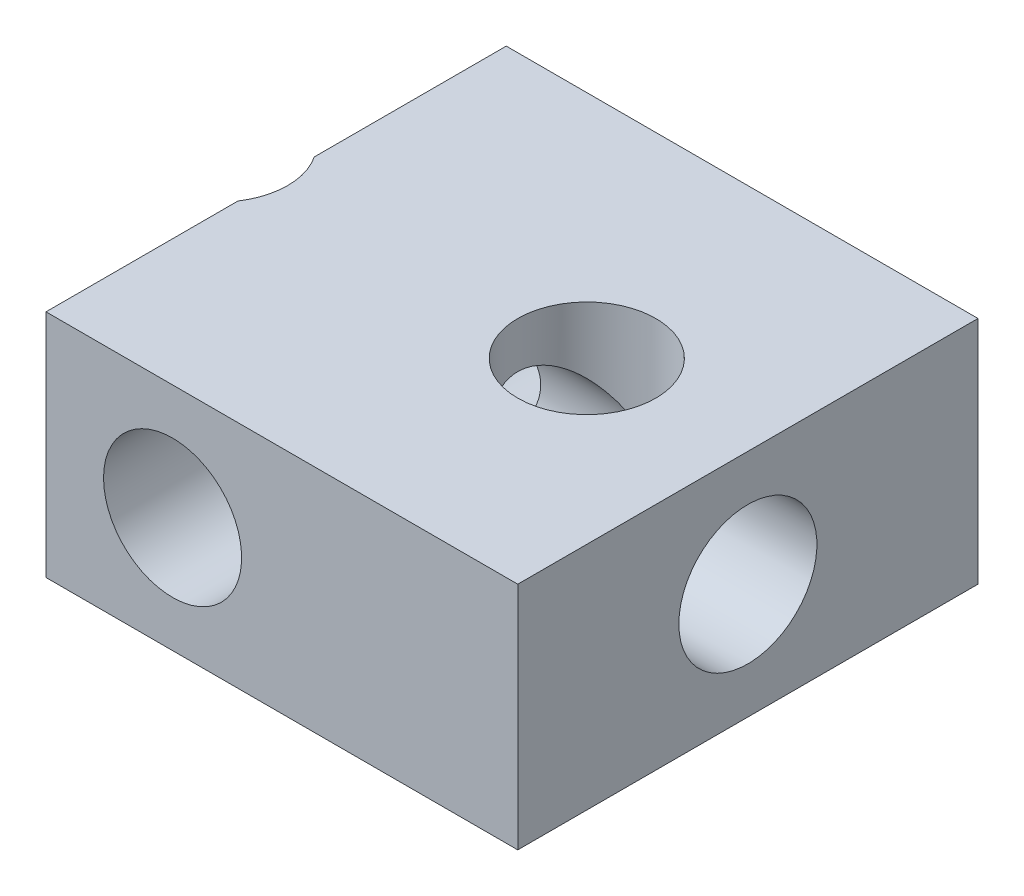
ISO-10303-21;
HEADER;
FILE_DESCRIPTION(('STEP AP214'),'2;1');
FILE_NAME('part.step','',(''),(''),'','','');
FILE_SCHEMA(('AUTOMOTIVE_DESIGN { 1 0 10303 214 1 1 1 1 }'));
ENDSEC;
DATA;
#1=APPLICATION_CONTEXT('core data for automotive mechanical design processes');
#2=APPLICATION_PROTOCOL_DEFINITION('international standard','automotive_design',2000,#1);
#3=PRODUCT_CONTEXT('',#1,'mechanical');
#4=PRODUCT('Part','Part','',(#3));
#5=PRODUCT_RELATED_PRODUCT_CATEGORY('part','',(#4));
#6=PRODUCT_DEFINITION_FORMATION('','',#4);
#7=PRODUCT_DEFINITION_CONTEXT('part definition',#1,'design');
#8=PRODUCT_DEFINITION('design','',#6,#7);
#9=PRODUCT_DEFINITION_SHAPE('','',#8);
#10=(LENGTH_UNIT() NAMED_UNIT(*) SI_UNIT(.MILLI.,.METRE.));
#11=(NAMED_UNIT(*) PLANE_ANGLE_UNIT() SI_UNIT($,.RADIAN.));
#12=(NAMED_UNIT(*) SI_UNIT($,.STERADIAN.) SOLID_ANGLE_UNIT());
#13=UNCERTAINTY_MEASURE_WITH_UNIT(LENGTH_MEASURE(1.E-05),#10,'distance_accuracy_value','');
#14=(GEOMETRIC_REPRESENTATION_CONTEXT(3) GLOBAL_UNCERTAINTY_ASSIGNED_CONTEXT((#13)) GLOBAL_UNIT_ASSIGNED_CONTEXT((#10,
#11,#12)) REPRESENTATION_CONTEXT('',''));
#15=CARTESIAN_POINT('',(0.,0.,0.));
#16=DIRECTION('',(0.,0.,1.));
#17=DIRECTION('',(1.,0.,0.));
#18=AXIS2_PLACEMENT_3D('',#15,#16,#17);
#19=CARTESIAN_POINT('',(7.5,2.5,0.));
#20=DIRECTION('',(-1.,0.,0.));
#21=DIRECTION('',(0.,0.,1.));
#22=AXIS2_PLACEMENT_3D('',#19,#20,#21);
#23=CYLINDRICAL_SURFACE('',#22,1.5);
#24=CARTESIAN_POINT('',(0.,2.5,0.));
#25=DIRECTION('',(-0.707106781186547,0.,0.707106781186547));
#26=DIRECTION('',(-0.707106781186548,0.,-0.707106781186547));
#27=AXIS2_PLACEMENT_3D('',#24,#25,#26);
#28=ELLIPSE('',#27,2.12132034355964,1.5);
#29=CARTESIAN_POINT('',(0.,1.,0.));
#30=VERTEX_POINT('',#29);
#31=CARTESIAN_POINT('',(0.,4.,0.));
#32=VERTEX_POINT('',#31);
#33=EDGE_CURVE('E153',#30,#32,#28,.F.);
#34=ORIENTED_EDGE('',*,*,#33,.T.);
#35=CARTESIAN_POINT('',(0.,2.5,0.));
#36=DIRECTION('',(-0.707106781186548,0.,-0.707106781186547));
#37=DIRECTION('',(-0.707106781186547,0.,0.707106781186547));
#38=AXIS2_PLACEMENT_3D('',#35,#36,#37);
#39=ELLIPSE('',#38,2.12132034355964,1.5);
#40=EDGE_CURVE('E161',#32,#30,#39,.F.);
#41=ORIENTED_EDGE('',*,*,#40,.T.);
#42=EDGE_LOOP('',(#34,#41));
#43=FACE_BOUND('',#42,.T.);
#44=CARTESIAN_POINT('',(-2.75,2.5,0.));
#45=DIRECTION('',(-1.,0.,0.));
#46=DIRECTION('',(0.,0.,1.));
#47=AXIS2_PLACEMENT_3D('',#44,#45,#46);
#48=CIRCLE('',#47,1.5);
#49=CARTESIAN_POINT('',(-2.75,1.25,-0.829156197588852));
#50=VERTEX_POINT('',#49);
#51=CARTESIAN_POINT('',(-2.75,3.75,-0.82915619758885));
#52=VERTEX_POINT('',#51);
#53=EDGE_CURVE('E169',#50,#52,#48,.F.);
#54=ORIENTED_EDGE('',*,*,#53,.F.);
#55=CARTESIAN_POINT('',(-4.,2.5,0.));
#56=DIRECTION('',(-0.707106781186547,-0.707106781186547,0.));
#57=DIRECTION('',(0.707106781186547,-0.707106781186547,0.));
#58=AXIS2_PLACEMENT_3D('',#55,#56,#57);
#59=ELLIPSE('',#58,2.12132034355964,1.5);
#60=CARTESIAN_POINT('',(-2.75,1.25,0.829156197588852));
#61=VERTEX_POINT('',#60);
#62=EDGE_CURVE('E150',#50,#61,#59,.T.);
#63=ORIENTED_EDGE('',*,*,#62,.T.);
#64=CARTESIAN_POINT('',(-2.75,3.75,0.829156197588849));
#65=VERTEX_POINT('',#64);
#66=EDGE_CURVE('E56',#65,#61,#48,.F.);
#67=ORIENTED_EDGE('',*,*,#66,.F.);
#68=CARTESIAN_POINT('',(-4.,2.5,0.));
#69=DIRECTION('',(0.707106781186547,-0.707106781186547,0.));
#70=DIRECTION('',(-0.707106781186547,-0.707106781186547,0.));
#71=AXIS2_PLACEMENT_3D('',#68,#69,#70);
#72=ELLIPSE('',#71,2.12132034355964,1.5);
#73=EDGE_CURVE('E147',#65,#52,#72,.F.);
#74=ORIENTED_EDGE('',*,*,#73,.T.);
#75=EDGE_LOOP('',(#54,#63,#67,#74));
#76=FACE_BOUND('',#75,.T.);
#77=ADVANCED_FACE('F34',(#43,#76),#23,.F.);
#78=CARTESIAN_POINT('',(-4.,5.,0.));
#79=DIRECTION('',(0.,-1.,0.));
#80=DIRECTION('',(0.,0.,-1.));
#81=AXIS2_PLACEMENT_3D('',#78,#79,#80);
#82=CYLINDRICAL_SURFACE('',#81,1.5);
#83=CARTESIAN_POINT('',(-4.,5.,0.));
#84=DIRECTION('',(0.,1.,0.));
#85=DIRECTION('',(0.,0.,1.));
#86=AXIS2_PLACEMENT_3D('',#83,#84,#85);
#87=CIRCLE('',#86,1.5);
#88=CARTESIAN_POINT('',(-2.75,5.,0.829156197588852));
#89=VERTEX_POINT('',#88);
#90=CARTESIAN_POINT('',(-2.75,5.,-0.829156197588852));
#91=VERTEX_POINT('',#90);
#92=EDGE_CURVE('E192',#89,#91,#87,.T.);
#93=ORIENTED_EDGE('',*,*,#92,.T.);
#94=DIRECTION('',(0.,-1.,0.));
#95=VECTOR('',#94,1.);
#96=CARTESIAN_POINT('',(-2.75,5.,-0.829156197588852));
#97=LINE('',#96,#95);
#98=EDGE_CURVE('E171',#91,#52,#97,.T.);
#99=ORIENTED_EDGE('',*,*,#98,.T.);
#100=ORIENTED_EDGE('',*,*,#73,.F.);
#101=DIRECTION('',(0.,-1.,0.));
#102=VECTOR('',#101,1.);
#103=CARTESIAN_POINT('',(-2.75,5.,0.829156197588852));
#104=LINE('',#103,#102);
#105=EDGE_CURVE('E172',#65,#89,#104,.F.);
#106=ORIENTED_EDGE('',*,*,#105,.T.);
#107=EDGE_LOOP('',(#93,#99,#100,#106));
#108=FACE_BOUND('',#107,.T.);
#109=ADVANCED_FACE('F265',(#108),#82,.F.);
#110=CARTESIAN_POINT('',(0.,5.,0.));
#111=DIRECTION('',(0.,1.,0.));
#112=DIRECTION('',(0.,0.,1.));
#113=AXIS2_PLACEMENT_3D('',#110,#111,#112);
#114=PLANE('',#113);
#115=CARTESIAN_POINT('',(4.,5.,0.));
#116=DIRECTION('',(0.,1.,0.));
#117=DIRECTION('',(0.,0.,1.));
#118=AXIS2_PLACEMENT_3D('',#115,#116,#117);
#119=CIRCLE('',#118,1.5);
#120=CARTESIAN_POINT('',(4.,5.,1.5));
#121=VERTEX_POINT('',#120);
#122=EDGE_CURVE('E199',#121,#121,#119,.T.);
#123=ORIENTED_EDGE('',*,*,#122,.F.);
#124=EDGE_LOOP('',(#123));
#125=FACE_BOUND('',#124,.T.);
#126=DIRECTION('',(-1.,0.,0.));
#127=VECTOR('',#126,1.);
#128=CARTESIAN_POINT('',(7.5,5.,-5.));
#129=LINE('',#128,#127);
#130=CARTESIAN_POINT('',(7.5,5.,-5.));
#131=VERTEX_POINT('',#130);
#132=CARTESIAN_POINT('',(-2.75,5.,-5.));
#133=VERTEX_POINT('',#132);
#134=EDGE_CURVE('E144',#131,#133,#129,.T.);
#135=ORIENTED_EDGE('',*,*,#134,.T.);
#136=DIRECTION('',(0.,0.,-1.));
#137=VECTOR('',#136,1.);
#138=CARTESIAN_POINT('',(-2.75,5.,5.));
#139=LINE('',#138,#137);
#140=EDGE_CURVE('E111',#91,#133,#139,.T.);
#141=ORIENTED_EDGE('',*,*,#140,.F.);
#142=ORIENTED_EDGE('',*,*,#92,.F.);
#143=CARTESIAN_POINT('',(-2.75,5.,5.));
#144=VERTEX_POINT('',#143);
#145=EDGE_CURVE('E179',#144,#89,#139,.T.);
#146=ORIENTED_EDGE('',*,*,#145,.F.);
#147=DIRECTION('',(1.,0.,0.));
#148=VECTOR('',#147,1.);
#149=CARTESIAN_POINT('',(7.5,5.,5.));
#150=LINE('',#149,#148);
#151=CARTESIAN_POINT('',(7.5,5.,5.));
#152=VERTEX_POINT('',#151);
#153=EDGE_CURVE('E133',#144,#152,#150,.T.);
#154=ORIENTED_EDGE('',*,*,#153,.T.);
#155=DIRECTION('',(0.,0.,-1.));
#156=VECTOR('',#155,1.);
#157=CARTESIAN_POINT('',(7.5,5.,5.));
#158=LINE('',#157,#156);
#159=EDGE_CURVE('E136',#152,#131,#158,.T.);
#160=ORIENTED_EDGE('',*,*,#159,.T.);
#161=EDGE_LOOP('',(#135,#141,#142,#146,#154,#160));
#162=FACE_BOUND('',#161,.T.);
#163=ADVANCED_FACE('F189',(#125,#162),#114,.T.);
#164=CARTESIAN_POINT('',(0.,0.,0.));
#165=DIRECTION('',(0.,1.,0.));
#166=DIRECTION('',(0.,0.,1.));
#167=AXIS2_PLACEMENT_3D('',#164,#165,#166);
#168=PLANE('',#167);
#169=CARTESIAN_POINT('',(4.,0.,0.));
#170=DIRECTION('',(0.,1.,0.));
#171=DIRECTION('',(0.,0.,1.));
#172=AXIS2_PLACEMENT_3D('',#169,#170,#171);
#173=CIRCLE('',#172,1.5);
#174=CARTESIAN_POINT('',(4.,0.,1.5));
#175=VERTEX_POINT('',#174);
#176=EDGE_CURVE('E201',#175,#175,#173,.T.);
#177=ORIENTED_EDGE('',*,*,#176,.T.);
#178=EDGE_LOOP('',(#177));
#179=FACE_BOUND('',#178,.T.);
#180=DIRECTION('',(0.,0.,1.));
#181=VECTOR('',#180,1.);
#182=CARTESIAN_POINT('',(-2.75,0.,-5.));
#183=LINE('',#182,#181);
#184=CARTESIAN_POINT('',(-2.75,0.,-5.));
#185=VERTEX_POINT('',#184);
#186=CARTESIAN_POINT('',(-2.75,0.,-0.829156197588852));
#187=VERTEX_POINT('',#186);
#188=EDGE_CURVE('E49',#185,#187,#183,.T.);
#189=ORIENTED_EDGE('',*,*,#188,.F.);
#190=DIRECTION('',(-1.,0.,0.));
#191=VECTOR('',#190,1.);
#192=CARTESIAN_POINT('',(7.5,0.,-5.));
#193=LINE('',#192,#191);
#194=CARTESIAN_POINT('',(7.5,0.,-5.));
#195=VERTEX_POINT('',#194);
#196=EDGE_CURVE('E123',#195,#185,#193,.T.);
#197=ORIENTED_EDGE('',*,*,#196,.F.);
#198=DIRECTION('',(0.,0.,-1.));
#199=VECTOR('',#198,1.);
#200=CARTESIAN_POINT('',(7.5,0.,5.));
#201=LINE('',#200,#199);
#202=CARTESIAN_POINT('',(7.5,0.,5.));
#203=VERTEX_POINT('',#202);
#204=EDGE_CURVE('E134',#203,#195,#201,.T.);
#205=ORIENTED_EDGE('',*,*,#204,.F.);
#206=DIRECTION('',(1.,0.,0.));
#207=VECTOR('',#206,1.);
#208=CARTESIAN_POINT('',(7.5,0.,5.));
#209=LINE('',#208,#207);
#210=CARTESIAN_POINT('',(-2.75,0.,5.));
#211=VERTEX_POINT('',#210);
#212=EDGE_CURVE('E138',#211,#203,#209,.T.);
#213=ORIENTED_EDGE('',*,*,#212,.F.);
#214=CARTESIAN_POINT('',(-2.75,0.,0.829156197588852));
#215=VERTEX_POINT('',#214);
#216=EDGE_CURVE('E116',#215,#211,#183,.T.);
#217=ORIENTED_EDGE('',*,*,#216,.F.);
#218=CARTESIAN_POINT('',(-4.,0.,0.));
#219=DIRECTION('',(0.,1.,0.));
#220=DIRECTION('',(0.,0.,1.));
#221=AXIS2_PLACEMENT_3D('',#218,#219,#220);
#222=CIRCLE('',#221,1.5);
#223=EDGE_CURVE('E126',#215,#187,#222,.T.);
#224=ORIENTED_EDGE('',*,*,#223,.T.);
#225=EDGE_LOOP('',(#189,#197,#205,#213,#217,#224));
#226=FACE_BOUND('',#225,.T.);
#227=ADVANCED_FACE('F121',(#179,#226),#168,.F.);
#228=CARTESIAN_POINT('',(7.5,5.,5.));
#229=DIRECTION('',(0.,0.,-1.));
#230=DIRECTION('',(-1.,0.,0.));
#231=AXIS2_PLACEMENT_3D('',#228,#229,#230);
#232=PLANE('',#231);
#233=CARTESIAN_POINT('',(0.,2.5,5.));
#234=DIRECTION('',(0.,0.,-1.));
#235=DIRECTION('',(-1.,0.,0.));
#236=AXIS2_PLACEMENT_3D('',#233,#234,#235);
#237=CIRCLE('',#236,1.5);
#238=CARTESIAN_POINT('',(-1.5,2.5,5.));
#239=VERTEX_POINT('',#238);
#240=EDGE_CURVE('E174',#239,#239,#237,.T.);
#241=ORIENTED_EDGE('',*,*,#240,.T.);
#242=EDGE_LOOP('',(#241));
#243=FACE_BOUND('',#242,.T.);
#244=DIRECTION('',(0.,1.,0.));
#245=VECTOR('',#244,1.);
#246=CARTESIAN_POINT('',(-2.75,0.,5.));
#247=LINE('',#246,#245);
#248=EDGE_CURVE('E127',#211,#144,#247,.T.);
#249=ORIENTED_EDGE('',*,*,#248,.F.);
#250=ORIENTED_EDGE('',*,*,#212,.T.);
#251=DIRECTION('',(0.,-1.,0.));
#252=VECTOR('',#251,1.);
#253=CARTESIAN_POINT('',(7.5,5.,5.));
#254=LINE('',#253,#252);
#255=EDGE_CURVE('E143',#152,#203,#254,.T.);
#256=ORIENTED_EDGE('',*,*,#255,.F.);
#257=ORIENTED_EDGE('',*,*,#153,.F.);
#258=EDGE_LOOP('',(#249,#250,#256,#257));
#259=FACE_BOUND('',#258,.T.);
#260=ADVANCED_FACE('F36',(#243,#259),#232,.F.);
#261=CARTESIAN_POINT('',(7.5,5.,-5.));
#262=DIRECTION('',(0.,0.,1.));
#263=DIRECTION('',(1.,0.,0.));
#264=AXIS2_PLACEMENT_3D('',#261,#262,#263);
#265=PLANE('',#264);
#266=CARTESIAN_POINT('',(0.,2.5,-5.));
#267=DIRECTION('',(0.,0.,1.));
#268=DIRECTION('',(1.,0.,0.));
#269=AXIS2_PLACEMENT_3D('',#266,#267,#268);
#270=CIRCLE('',#269,1.5);
#271=CARTESIAN_POINT('',(1.5,2.5,-5.));
#272=VERTEX_POINT('',#271);
#273=EDGE_CURVE('E223',#272,#272,#270,.T.);
#274=ORIENTED_EDGE('',*,*,#273,.T.);
#275=EDGE_LOOP('',(#274));
#276=FACE_BOUND('',#275,.T.);
#277=DIRECTION('',(0.,-1.,0.));
#278=VECTOR('',#277,1.);
#279=CARTESIAN_POINT('',(-2.75,5.,-5.));
#280=LINE('',#279,#278);
#281=EDGE_CURVE('E108',#133,#185,#280,.T.);
#282=ORIENTED_EDGE('',*,*,#281,.F.);
#283=ORIENTED_EDGE('',*,*,#134,.F.);
#284=DIRECTION('',(0.,-1.,0.));
#285=VECTOR('',#284,1.);
#286=CARTESIAN_POINT('',(7.5,5.,-5.));
#287=LINE('',#286,#285);
#288=EDGE_CURVE('E132',#131,#195,#287,.T.);
#289=ORIENTED_EDGE('',*,*,#288,.T.);
#290=ORIENTED_EDGE('',*,*,#196,.T.);
#291=EDGE_LOOP('',(#282,#283,#289,#290));
#292=FACE_BOUND('',#291,.T.);
#293=ADVANCED_FACE('F130',(#276,#292),#265,.F.);
#294=ORIENTED_EDGE('',*,*,#62,.F.);
#295=DIRECTION('',(0.,-1.,0.));
#296=VECTOR('',#295,1.);
#297=CARTESIAN_POINT('',(-2.75,5.,-0.829156197588852));
#298=LINE('',#297,#296);
#299=EDGE_CURVE('E11',#50,#187,#298,.T.);
#300=ORIENTED_EDGE('',*,*,#299,.T.);
#301=ORIENTED_EDGE('',*,*,#223,.F.);
#302=DIRECTION('',(0.,-1.,0.));
#303=VECTOR('',#302,1.);
#304=CARTESIAN_POINT('',(-2.75,5.,0.829156197588852));
#305=LINE('',#304,#303);
#306=EDGE_CURVE('E42',#215,#61,#305,.F.);
#307=ORIENTED_EDGE('',*,*,#306,.T.);
#308=EDGE_LOOP('',(#294,#300,#301,#307));
#309=FACE_BOUND('',#308,.T.);
#310=ADVANCED_FACE('F165',(#309),#82,.F.);
#311=CARTESIAN_POINT('',(4.,5.,0.));
#312=DIRECTION('',(0.,-1.,0.));
#313=DIRECTION('',(0.,0.,-1.));
#314=AXIS2_PLACEMENT_3D('',#311,#312,#313);
#315=CYLINDRICAL_SURFACE('',#314,1.5);
#316=CARTESIAN_POINT('',(4.,2.5,0.));
#317=DIRECTION('',(-0.707106781186547,-0.707106781186547,0.));
#318=DIRECTION('',(0.707106781186547,-0.707106781186547,0.));
#319=AXIS2_PLACEMENT_3D('',#316,#317,#318);
#320=ELLIPSE('',#319,2.12132034355964,1.5);
#321=CARTESIAN_POINT('',(4.,2.5,-1.5));
#322=VERTEX_POINT('',#321);
#323=CARTESIAN_POINT('',(4.,2.5,1.5));
#324=VERTEX_POINT('',#323);
#325=EDGE_CURVE('E208',#322,#324,#320,.F.);
#326=ORIENTED_EDGE('',*,*,#325,.F.);
#327=CARTESIAN_POINT('',(4.,2.5,0.));
#328=DIRECTION('',(0.707106781186547,-0.707106781186547,0.));
#329=DIRECTION('',(-0.707106781186547,-0.707106781186547,0.));
#330=AXIS2_PLACEMENT_3D('',#327,#328,#329);
#331=ELLIPSE('',#330,2.12132034355964,1.5);
#332=EDGE_CURVE('E217',#324,#322,#331,.F.);
#333=ORIENTED_EDGE('',*,*,#332,.F.);
#334=EDGE_LOOP('',(#326,#333));
#335=FACE_BOUND('',#334,.T.);
#336=ORIENTED_EDGE('',*,*,#122,.T.);
#337=EDGE_LOOP('',(#336));
#338=FACE_BOUND('',#337,.T.);
#339=ADVANCED_FACE('F256',(#335,#338),#315,.F.);
#340=CARTESIAN_POINT('',(7.5,5.,5.));
#341=DIRECTION('',(-1.,0.,0.));
#342=DIRECTION('',(0.,0.,1.));
#343=AXIS2_PLACEMENT_3D('',#340,#341,#342);
#344=PLANE('',#343);
#345=CARTESIAN_POINT('',(7.5,2.5,0.));
#346=DIRECTION('',(-1.,0.,0.));
#347=DIRECTION('',(0.,0.,1.));
#348=AXIS2_PLACEMENT_3D('',#345,#346,#347);
#349=CIRCLE('',#348,1.5);
#350=CARTESIAN_POINT('',(7.5,2.5,1.5));
#351=VERTEX_POINT('',#350);
#352=EDGE_CURVE('E220',#351,#351,#349,.T.);
#353=ORIENTED_EDGE('',*,*,#352,.T.);
#354=EDGE_LOOP('',(#353));
#355=FACE_BOUND('',#354,.T.);
#356=ORIENTED_EDGE('',*,*,#204,.T.);
#357=ORIENTED_EDGE('',*,*,#288,.F.);
#358=ORIENTED_EDGE('',*,*,#159,.F.);
#359=ORIENTED_EDGE('',*,*,#255,.T.);
#360=EDGE_LOOP('',(#356,#357,#358,#359));
#361=FACE_BOUND('',#360,.T.);
#362=ADVANCED_FACE('F195',(#355,#361),#344,.F.);
#363=CARTESIAN_POINT('',(4.,2.5,0.));
#364=DIRECTION('',(-0.707106781186547,-0.707106781186547,0.));
#365=DIRECTION('',(0.707106781186547,-0.707106781186547,0.));
#366=AXIS2_PLACEMENT_3D('',#363,#364,#365);
#367=ELLIPSE('',#366,2.12132034355964,1.5);
#368=EDGE_CURVE('E212',#322,#324,#367,.T.);
#369=ORIENTED_EDGE('',*,*,#368,.F.);
#370=CARTESIAN_POINT('',(4.,2.5,0.));
#371=DIRECTION('',(0.707106781186547,-0.707106781186547,0.));
#372=DIRECTION('',(-0.707106781186547,-0.707106781186547,0.));
#373=AXIS2_PLACEMENT_3D('',#370,#371,#372);
#374=ELLIPSE('',#373,2.12132034355964,1.5);
#375=EDGE_CURVE('E215',#324,#322,#374,.T.);
#376=ORIENTED_EDGE('',*,*,#375,.F.);
#377=EDGE_LOOP('',(#369,#376));
#378=FACE_BOUND('',#377,.T.);
#379=ORIENTED_EDGE('',*,*,#176,.F.);
#380=EDGE_LOOP('',(#379));
#381=FACE_BOUND('',#380,.T.);
#382=ADVANCED_FACE('F246',(#378,#381),#315,.F.);
#383=CARTESIAN_POINT('',(0.,2.5,0.));
#384=DIRECTION('',(-0.707106781186547,0.,0.707106781186547));
#385=DIRECTION('',(-0.707106781186548,0.,-0.707106781186547));
#386=AXIS2_PLACEMENT_3D('',#383,#384,#385);
#387=ELLIPSE('',#386,2.12132034355964,1.5);
#388=EDGE_CURVE('E155',#30,#32,#387,.T.);
#389=ORIENTED_EDGE('',*,*,#388,.T.);
#390=CARTESIAN_POINT('',(0.,2.5,0.));
#391=DIRECTION('',(-0.707106781186548,0.,-0.707106781186547));
#392=DIRECTION('',(-0.707106781186547,0.,0.707106781186547));
#393=AXIS2_PLACEMENT_3D('',#390,#391,#392);
#394=ELLIPSE('',#393,2.12132034355964,1.5);
#395=EDGE_CURVE('E158',#32,#30,#394,.T.);
#396=ORIENTED_EDGE('',*,*,#395,.T.);
#397=EDGE_LOOP('',(#389,#396));
#398=FACE_BOUND('',#397,.T.);
#399=ORIENTED_EDGE('',*,*,#325,.T.);
#400=ORIENTED_EDGE('',*,*,#375,.T.);
#401=EDGE_LOOP('',(#399,#400));
#402=FACE_BOUND('',#401,.T.);
#403=ADVANCED_FACE('F242',(#398,#402),#23,.F.);
#404=ORIENTED_EDGE('',*,*,#368,.T.);
#405=ORIENTED_EDGE('',*,*,#332,.T.);
#406=EDGE_LOOP('',(#404,#405));
#407=FACE_BOUND('',#406,.T.);
#408=ORIENTED_EDGE('',*,*,#352,.F.);
#409=EDGE_LOOP('',(#408));
#410=FACE_BOUND('',#409,.T.);
#411=ADVANCED_FACE('F245',(#407,#410),#23,.F.);
#412=CARTESIAN_POINT('',(0.,2.5,5.));
#413=DIRECTION('',(0.,0.,-1.));
#414=DIRECTION('',(-1.,0.,0.));
#415=AXIS2_PLACEMENT_3D('',#412,#413,#414);
#416=CYLINDRICAL_SURFACE('',#415,1.5);
#417=ORIENTED_EDGE('',*,*,#33,.F.);
#418=ORIENTED_EDGE('',*,*,#395,.F.);
#419=EDGE_LOOP('',(#417,#418));
#420=FACE_BOUND('',#419,.T.);
#421=ORIENTED_EDGE('',*,*,#273,.F.);
#422=EDGE_LOOP('',(#421));
#423=FACE_BOUND('',#422,.T.);
#424=ADVANCED_FACE('F233',(#420,#423),#416,.F.);
#425=ORIENTED_EDGE('',*,*,#240,.F.);
#426=EDGE_LOOP('',(#425));
#427=FACE_BOUND('',#426,.T.);
#428=ORIENTED_EDGE('',*,*,#388,.F.);
#429=ORIENTED_EDGE('',*,*,#40,.F.);
#430=EDGE_LOOP('',(#428,#429));
#431=FACE_BOUND('',#430,.T.);
#432=ADVANCED_FACE('F230',(#427,#431),#416,.F.);
#433=CARTESIAN_POINT('',(-2.75,0.,0.));
#434=DIRECTION('',(-1.,0.,0.));
#435=DIRECTION('',(0.,0.,1.));
#436=AXIS2_PLACEMENT_3D('',#433,#434,#435);
#437=PLANE('',#436);
#438=ORIENTED_EDGE('',*,*,#66,.T.);
#439=ORIENTED_EDGE('',*,*,#306,.F.);
#440=ORIENTED_EDGE('',*,*,#216,.T.);
#441=ORIENTED_EDGE('',*,*,#248,.T.);
#442=ORIENTED_EDGE('',*,*,#145,.T.);
#443=ORIENTED_EDGE('',*,*,#105,.F.);
#444=EDGE_LOOP('',(#438,#439,#440,#441,#442,#443));
#445=FACE_BOUND('',#444,.T.);
#446=ADVANCED_FACE('F183',(#445),#437,.T.);
#447=ORIENTED_EDGE('',*,*,#140,.T.);
#448=ORIENTED_EDGE('',*,*,#281,.T.);
#449=ORIENTED_EDGE('',*,*,#188,.T.);
#450=ORIENTED_EDGE('',*,*,#299,.F.);
#451=ORIENTED_EDGE('',*,*,#53,.T.);
#452=ORIENTED_EDGE('',*,*,#98,.F.);
#453=EDGE_LOOP('',(#447,#448,#449,#450,#451,#452));
#454=FACE_BOUND('',#453,.T.);
#455=ADVANCED_FACE('F109',(#454),#437,.T.);
#456=CLOSED_SHELL('',(#77,#109,#163,#227,#260,#293,#310,#339,#362,#382,#403,#411,#424,#432,#446,#455));
#457=MANIFOLD_SOLID_BREP('B2',#456);
#458=ADVANCED_BREP_SHAPE_REPRESENTATION('',(#18,#457),#14);
#459=SHAPE_DEFINITION_REPRESENTATION(#9,#458);
ENDSEC;
END-ISO-10303-21;
